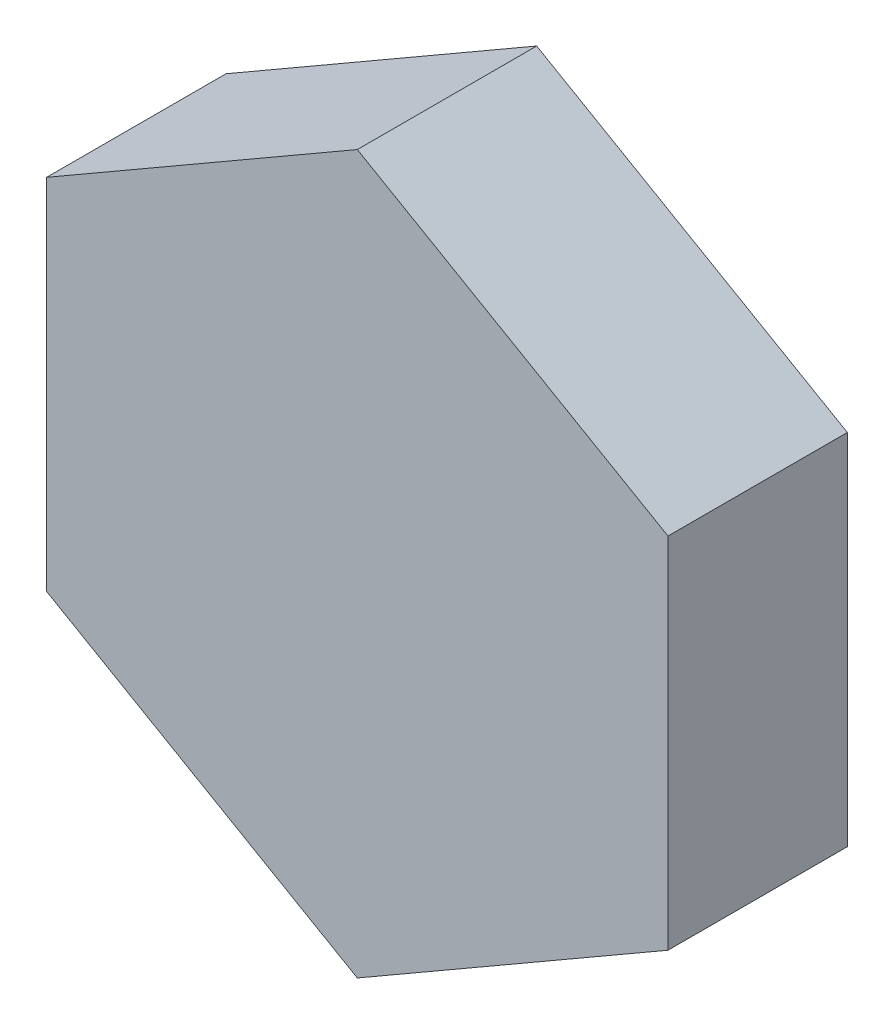
ISO-10303-21;
HEADER;
FILE_DESCRIPTION(('STEP AP214'),'2;1');
FILE_NAME('part.step','',(''),(''),'','','');
FILE_SCHEMA(('AUTOMOTIVE_DESIGN { 1 0 10303 214 1 1 1 1 }'));
ENDSEC;
DATA;
#1=APPLICATION_CONTEXT('core data for automotive mechanical design processes');
#2=APPLICATION_PROTOCOL_DEFINITION('international standard','automotive_design',2000,#1);
#3=PRODUCT_CONTEXT('',#1,'mechanical');
#4=PRODUCT('Part','Part','',(#3));
#5=PRODUCT_RELATED_PRODUCT_CATEGORY('part','',(#4));
#6=PRODUCT_DEFINITION_FORMATION('','',#4);
#7=PRODUCT_DEFINITION_CONTEXT('part definition',#1,'design');
#8=PRODUCT_DEFINITION('design','',#6,#7);
#9=PRODUCT_DEFINITION_SHAPE('','',#8);
#10=(LENGTH_UNIT() NAMED_UNIT(*) SI_UNIT(.MILLI.,.METRE.));
#11=(NAMED_UNIT(*) PLANE_ANGLE_UNIT() SI_UNIT($,.RADIAN.));
#12=(NAMED_UNIT(*) SI_UNIT($,.STERADIAN.) SOLID_ANGLE_UNIT());
#13=UNCERTAINTY_MEASURE_WITH_UNIT(LENGTH_MEASURE(1.E-05),#10,'distance_accuracy_value','');
#14=(GEOMETRIC_REPRESENTATION_CONTEXT(3) GLOBAL_UNCERTAINTY_ASSIGNED_CONTEXT((#13)) GLOBAL_UNIT_ASSIGNED_CONTEXT((#10,
#11,#12)) REPRESENTATION_CONTEXT('',''));
#15=CARTESIAN_POINT('',(0.,0.,0.));
#16=DIRECTION('',(0.,0.,1.));
#17=DIRECTION('',(1.,0.,0.));
#18=AXIS2_PLACEMENT_3D('',#15,#16,#17);
#19=CARTESIAN_POINT('',(0.,-50.8000000000001,25.4));
#20=DIRECTION('',(-0.5,0.866025403784439,0.));
#21=DIRECTION('',(-0.866025403784439,-0.5,0.));
#22=AXIS2_PLACEMENT_3D('',#19,#20,#21);
#23=PLANE('',#22);
#24=DIRECTION('',(0.866025403784439,0.5,0.));
#25=VECTOR('',#24,1.);
#26=CARTESIAN_POINT('',(0.,-50.8000000000001,0.));
#27=LINE('',#26,#25);
#28=CARTESIAN_POINT('',(0.,-50.8000000000001,0.));
#29=VERTEX_POINT('',#28);
#30=CARTESIAN_POINT('',(43.9940905122495,-25.4000000000001,0.));
#31=VERTEX_POINT('',#30);
#32=EDGE_CURVE('E116',#29,#31,#27,.T.);
#33=ORIENTED_EDGE('',*,*,#32,.T.);
#34=DIRECTION('',(0.,0.,-1.));
#35=VECTOR('',#34,1.);
#36=CARTESIAN_POINT('',(43.9940905122495,-25.4000000000001,25.4));
#37=LINE('',#36,#35);
#38=CARTESIAN_POINT('',(43.9940905122495,-25.4000000000001,25.4));
#39=VERTEX_POINT('',#38);
#40=EDGE_CURVE('E11',#39,#31,#37,.T.);
#41=ORIENTED_EDGE('',*,*,#40,.F.);
#42=DIRECTION('',(0.866025403784439,0.5,0.));
#43=VECTOR('',#42,1.);
#44=CARTESIAN_POINT('',(0.,-50.8000000000001,25.4));
#45=LINE('',#44,#43);
#46=CARTESIAN_POINT('',(0.,-50.8000000000001,25.4));
#47=VERTEX_POINT('',#46);
#48=EDGE_CURVE('E126',#47,#39,#45,.T.);
#49=ORIENTED_EDGE('',*,*,#48,.F.);
#50=DIRECTION('',(0.,0.,-1.));
#51=VECTOR('',#50,1.);
#52=CARTESIAN_POINT('',(0.,-50.8000000000001,25.4));
#53=LINE('',#52,#51);
#54=EDGE_CURVE('E112',#47,#29,#53,.T.);
#55=ORIENTED_EDGE('',*,*,#54,.T.);
#56=EDGE_LOOP('',(#33,#41,#49,#55));
#57=FACE_BOUND('',#56,.T.);
#58=ADVANCED_FACE('F32',(#57),#23,.F.);
#59=CARTESIAN_POINT('',(43.9940905122495,-25.4000000000001,25.4));
#60=DIRECTION('',(-1.,0.,0.));
#61=DIRECTION('',(0.,0.,1.));
#62=AXIS2_PLACEMENT_3D('',#59,#60,#61);
#63=PLANE('',#62);
#64=DIRECTION('',(0.,1.,0.));
#65=VECTOR('',#64,1.);
#66=CARTESIAN_POINT('',(43.9940905122495,-25.4000000000001,0.));
#67=LINE('',#66,#65);
#68=CARTESIAN_POINT('',(43.9940905122495,25.4,0.));
#69=VERTEX_POINT('',#68);
#70=EDGE_CURVE('E119',#31,#69,#67,.T.);
#71=ORIENTED_EDGE('',*,*,#70,.T.);
#72=DIRECTION('',(0.,0.,-1.));
#73=VECTOR('',#72,1.);
#74=CARTESIAN_POINT('',(43.9940905122495,25.4,25.4));
#75=LINE('',#74,#73);
#76=CARTESIAN_POINT('',(43.9940905122495,25.4,25.4));
#77=VERTEX_POINT('',#76);
#78=EDGE_CURVE('E40',#77,#69,#75,.T.);
#79=ORIENTED_EDGE('',*,*,#78,.F.);
#80=DIRECTION('',(0.,1.,0.));
#81=VECTOR('',#80,1.);
#82=CARTESIAN_POINT('',(43.9940905122495,-25.4000000000001,25.4));
#83=LINE('',#82,#81);
#84=EDGE_CURVE('E85',#39,#77,#83,.T.);
#85=ORIENTED_EDGE('',*,*,#84,.F.);
#86=ORIENTED_EDGE('',*,*,#40,.T.);
#87=EDGE_LOOP('',(#71,#79,#85,#86));
#88=FACE_BOUND('',#87,.T.);
#89=ADVANCED_FACE('F150',(#88),#63,.F.);
#90=CARTESIAN_POINT('',(43.9940905122495,25.4,25.4));
#91=DIRECTION('',(-0.5,-0.866025403784438,0.));
#92=DIRECTION('',(0.866025403784439,-0.5,0.));
#93=AXIS2_PLACEMENT_3D('',#90,#91,#92);
#94=PLANE('',#93);
#95=DIRECTION('',(-0.866025403784439,0.5,0.));
#96=VECTOR('',#95,1.);
#97=CARTESIAN_POINT('',(43.9940905122495,25.4,0.));
#98=LINE('',#97,#96);
#99=CARTESIAN_POINT('',(0.,50.8000000000001,0.));
#100=VERTEX_POINT('',#99);
#101=EDGE_CURVE('E121',#69,#100,#98,.T.);
#102=ORIENTED_EDGE('',*,*,#101,.T.);
#103=DIRECTION('',(0.,0.,-1.));
#104=VECTOR('',#103,1.);
#105=CARTESIAN_POINT('',(0.,50.8000000000001,25.4));
#106=LINE('',#105,#104);
#107=CARTESIAN_POINT('',(0.,50.8000000000001,25.4));
#108=VERTEX_POINT('',#107);
#109=EDGE_CURVE('E107',#108,#100,#106,.T.);
#110=ORIENTED_EDGE('',*,*,#109,.F.);
#111=DIRECTION('',(-0.866025403784439,0.5,0.));
#112=VECTOR('',#111,1.);
#113=CARTESIAN_POINT('',(43.9940905122495,25.4,25.4));
#114=LINE('',#113,#112);
#115=EDGE_CURVE('E98',#77,#108,#114,.T.);
#116=ORIENTED_EDGE('',*,*,#115,.F.);
#117=ORIENTED_EDGE('',*,*,#78,.T.);
#118=EDGE_LOOP('',(#102,#110,#116,#117));
#119=FACE_BOUND('',#118,.T.);
#120=ADVANCED_FACE('F132',(#119),#94,.F.);
#121=CARTESIAN_POINT('',(0.,50.8000000000001,25.4));
#122=DIRECTION('',(0.5,-0.866025403784439,0.));
#123=DIRECTION('',(0.866025403784439,0.5,0.));
#124=AXIS2_PLACEMENT_3D('',#121,#122,#123);
#125=PLANE('',#124);
#126=DIRECTION('',(-0.866025403784439,-0.5,0.));
#127=VECTOR('',#126,1.);
#128=CARTESIAN_POINT('',(0.,50.8000000000001,0.));
#129=LINE('',#128,#127);
#130=CARTESIAN_POINT('',(-43.9940905122495,25.4000000000001,0.));
#131=VERTEX_POINT('',#130);
#132=EDGE_CURVE('E106',#100,#131,#129,.T.);
#133=ORIENTED_EDGE('',*,*,#132,.T.);
#134=DIRECTION('',(0.,0.,-1.));
#135=VECTOR('',#134,1.);
#136=CARTESIAN_POINT('',(-43.9940905122495,25.4000000000001,25.4));
#137=LINE('',#136,#135);
#138=CARTESIAN_POINT('',(-43.9940905122495,25.4000000000001,25.4));
#139=VERTEX_POINT('',#138);
#140=EDGE_CURVE('E103',#139,#131,#137,.T.);
#141=ORIENTED_EDGE('',*,*,#140,.F.);
#142=DIRECTION('',(-0.866025403784439,-0.5,0.));
#143=VECTOR('',#142,1.);
#144=CARTESIAN_POINT('',(0.,50.8000000000001,25.4));
#145=LINE('',#144,#143);
#146=EDGE_CURVE('E92',#108,#139,#145,.T.);
#147=ORIENTED_EDGE('',*,*,#146,.F.);
#148=ORIENTED_EDGE('',*,*,#109,.T.);
#149=EDGE_LOOP('',(#133,#141,#147,#148));
#150=FACE_BOUND('',#149,.T.);
#151=ADVANCED_FACE('F104',(#150),#125,.F.);
#152=CARTESIAN_POINT('',(-43.9940905122495,25.4000000000001,25.4));
#153=DIRECTION('',(1.,0.,0.));
#154=DIRECTION('',(0.,0.,-1.));
#155=AXIS2_PLACEMENT_3D('',#152,#153,#154);
#156=PLANE('',#155);
#157=DIRECTION('',(0.,-1.,0.));
#158=VECTOR('',#157,1.);
#159=CARTESIAN_POINT('',(-43.9940905122495,25.4000000000001,0.));
#160=LINE('',#159,#158);
#161=CARTESIAN_POINT('',(-43.9940905122495,-25.4,0.));
#162=VERTEX_POINT('',#161);
#163=EDGE_CURVE('E71',#131,#162,#160,.T.);
#164=ORIENTED_EDGE('',*,*,#163,.T.);
#165=DIRECTION('',(0.,0.,-1.));
#166=VECTOR('',#165,1.);
#167=CARTESIAN_POINT('',(-43.9940905122495,-25.4,25.4));
#168=LINE('',#167,#166);
#169=CARTESIAN_POINT('',(-43.9940905122495,-25.4,25.4));
#170=VERTEX_POINT('',#169);
#171=EDGE_CURVE('E108',#170,#162,#168,.T.);
#172=ORIENTED_EDGE('',*,*,#171,.F.);
#173=DIRECTION('',(0.,-1.,0.));
#174=VECTOR('',#173,1.);
#175=CARTESIAN_POINT('',(-43.9940905122495,25.4000000000001,25.4));
#176=LINE('',#175,#174);
#177=EDGE_CURVE('E96',#139,#170,#176,.T.);
#178=ORIENTED_EDGE('',*,*,#177,.F.);
#179=ORIENTED_EDGE('',*,*,#140,.T.);
#180=EDGE_LOOP('',(#164,#172,#178,#179));
#181=FACE_BOUND('',#180,.T.);
#182=ADVANCED_FACE('F110',(#181),#156,.F.);
#183=CARTESIAN_POINT('',(-43.9940905122495,-25.4,25.4));
#184=DIRECTION('',(0.5,0.866025403784438,0.));
#185=DIRECTION('',(-0.866025403784438,0.5,0.));
#186=AXIS2_PLACEMENT_3D('',#183,#184,#185);
#187=PLANE('',#186);
#188=DIRECTION('',(0.866025403784438,-0.5,0.));
#189=VECTOR('',#188,1.);
#190=CARTESIAN_POINT('',(-43.9940905122495,-25.4,0.));
#191=LINE('',#190,#189);
#192=EDGE_CURVE('E77',#162,#29,#191,.T.);
#193=ORIENTED_EDGE('',*,*,#192,.T.);
#194=ORIENTED_EDGE('',*,*,#54,.F.);
#195=DIRECTION('',(0.866025403784438,-0.5,0.));
#196=VECTOR('',#195,1.);
#197=CARTESIAN_POINT('',(-43.9940905122495,-25.4,25.4));
#198=LINE('',#197,#196);
#199=EDGE_CURVE('E48',#170,#47,#198,.T.);
#200=ORIENTED_EDGE('',*,*,#199,.F.);
#201=ORIENTED_EDGE('',*,*,#171,.T.);
#202=EDGE_LOOP('',(#193,#194,#200,#201));
#203=FACE_BOUND('',#202,.T.);
#204=ADVANCED_FACE('F139',(#203),#187,.F.);
#205=CARTESIAN_POINT('',(0.,0.,25.4));
#206=DIRECTION('',(0.,0.,1.));
#207=DIRECTION('',(1.,0.,0.));
#208=AXIS2_PLACEMENT_3D('',#205,#206,#207);
#209=PLANE('',#208);
#210=ORIENTED_EDGE('',*,*,#48,.T.);
#211=ORIENTED_EDGE('',*,*,#84,.T.);
#212=ORIENTED_EDGE('',*,*,#115,.T.);
#213=ORIENTED_EDGE('',*,*,#146,.T.);
#214=ORIENTED_EDGE('',*,*,#177,.T.);
#215=ORIENTED_EDGE('',*,*,#199,.T.);
#216=EDGE_LOOP('',(#210,#211,#212,#213,#214,#215));
#217=FACE_BOUND('',#216,.T.);
#218=ADVANCED_FACE('F94',(#217),#209,.T.);
#219=CARTESIAN_POINT('',(0.,0.,0.));
#220=DIRECTION('',(0.,0.,1.));
#221=DIRECTION('',(1.,0.,0.));
#222=AXIS2_PLACEMENT_3D('',#219,#220,#221);
#223=PLANE('',#222);
#224=ORIENTED_EDGE('',*,*,#32,.F.);
#225=ORIENTED_EDGE('',*,*,#192,.F.);
#226=ORIENTED_EDGE('',*,*,#163,.F.);
#227=ORIENTED_EDGE('',*,*,#132,.F.);
#228=ORIENTED_EDGE('',*,*,#101,.F.);
#229=ORIENTED_EDGE('',*,*,#70,.F.);
#230=EDGE_LOOP('',(#224,#225,#226,#227,#228,#229));
#231=FACE_BOUND('',#230,.T.);
#232=ADVANCED_FACE('F135',(#231),#223,.F.);
#233=CLOSED_SHELL('',(#58,#89,#120,#151,#182,#204,#218,#232));
#234=MANIFOLD_SOLID_BREP('B2',#233);
#235=ADVANCED_BREP_SHAPE_REPRESENTATION('',(#18,#234),#14);
#236=SHAPE_DEFINITION_REPRESENTATION(#9,#235);
ENDSEC;
END-ISO-10303-21;
